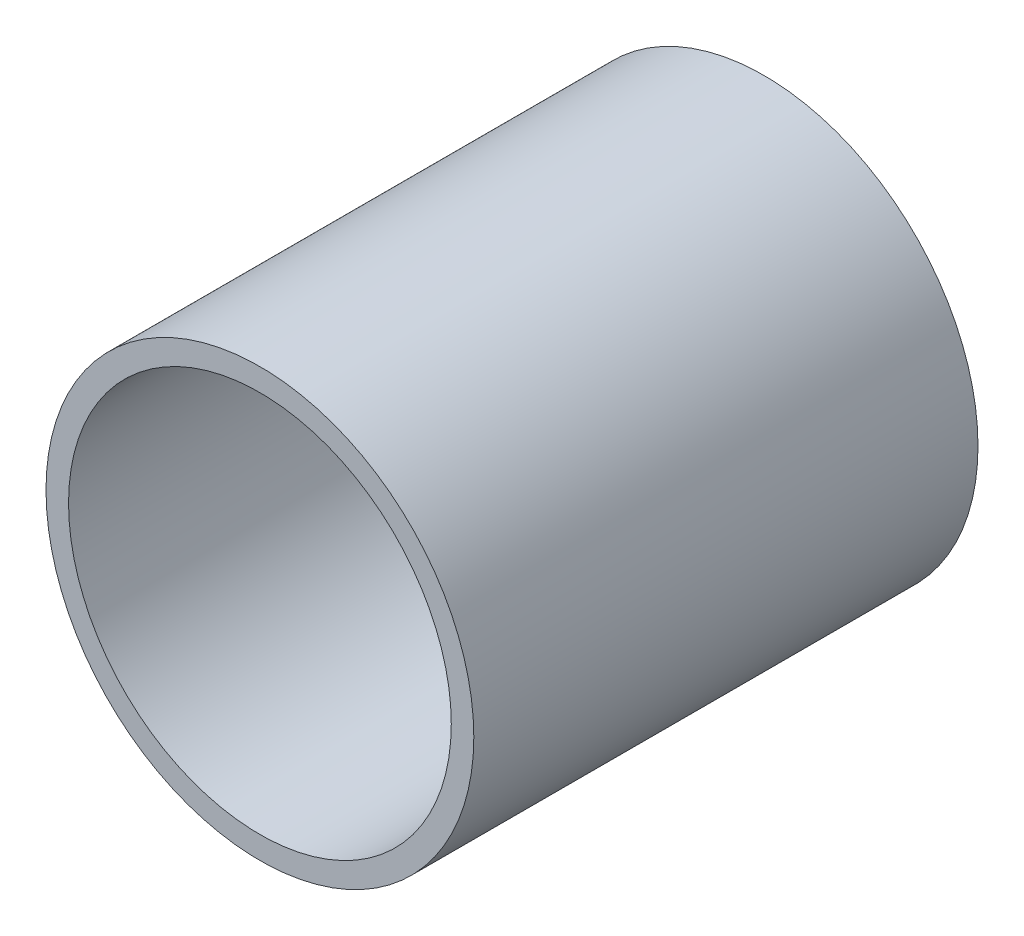
ISO-10303-21;
HEADER;
FILE_DESCRIPTION(('STEP AP214'),'2;1');
FILE_NAME('part.step','',(''),(''),'','','');
FILE_SCHEMA(('AUTOMOTIVE_DESIGN { 1 0 10303 214 1 1 1 1 }'));
ENDSEC;
DATA;
#1=APPLICATION_CONTEXT('core data for automotive mechanical design processes');
#2=APPLICATION_PROTOCOL_DEFINITION('international standard','automotive_design',2000,#1);
#3=PRODUCT_CONTEXT('',#1,'mechanical');
#4=PRODUCT('Part','Part','',(#3));
#5=PRODUCT_RELATED_PRODUCT_CATEGORY('part','',(#4));
#6=PRODUCT_DEFINITION_FORMATION('','',#4);
#7=PRODUCT_DEFINITION_CONTEXT('part definition',#1,'design');
#8=PRODUCT_DEFINITION('design','',#6,#7);
#9=PRODUCT_DEFINITION_SHAPE('','',#8);
#10=(LENGTH_UNIT() NAMED_UNIT(*) SI_UNIT(.MILLI.,.METRE.));
#11=(NAMED_UNIT(*) PLANE_ANGLE_UNIT() SI_UNIT($,.RADIAN.));
#12=(NAMED_UNIT(*) SI_UNIT($,.STERADIAN.) SOLID_ANGLE_UNIT());
#13=UNCERTAINTY_MEASURE_WITH_UNIT(LENGTH_MEASURE(1.E-05),#10,'distance_accuracy_value','');
#14=(GEOMETRIC_REPRESENTATION_CONTEXT(3) GLOBAL_UNCERTAINTY_ASSIGNED_CONTEXT((#13)) GLOBAL_UNIT_ASSIGNED_CONTEXT((#10,
#11,#12)) REPRESENTATION_CONTEXT('',''));
#15=CARTESIAN_POINT('',(0.,0.,0.));
#16=DIRECTION('',(0.,0.,1.));
#17=DIRECTION('',(1.,0.,0.));
#18=AXIS2_PLACEMENT_3D('',#15,#16,#17);
#19=CARTESIAN_POINT('',(0.,0.,67.35));
#20=DIRECTION('',(0.,0.,1.));
#21=DIRECTION('',(1.,0.,0.));
#22=AXIS2_PLACEMENT_3D('',#19,#20,#21);
#23=PLANE('',#22);
#24=CARTESIAN_POINT('',(0.,0.,67.35));
#25=DIRECTION('',(0.,0.,1.));
#26=DIRECTION('',(1.,0.,0.));
#27=AXIS2_PLACEMENT_3D('',#24,#25,#26);
#28=CIRCLE('',#27,57.15);
#29=CARTESIAN_POINT('',(57.15,0.,67.35));
#30=VERTEX_POINT('',#29);
#31=EDGE_CURVE('E11',#30,#30,#28,.T.);
#32=ORIENTED_EDGE('',*,*,#31,.T.);
#33=EDGE_LOOP('',(#32));
#34=FACE_BOUND('',#33,.T.);
#35=CARTESIAN_POINT('',(0.,0.,67.35));
#36=DIRECTION('',(0.,0.,1.));
#37=DIRECTION('',(1.,0.,0.));
#38=AXIS2_PLACEMENT_3D('',#35,#36,#37);
#39=CIRCLE('',#38,51.1302);
#40=CARTESIAN_POINT('',(51.1302,0.,67.35));
#41=VERTEX_POINT('',#40);
#42=EDGE_CURVE('E50',#41,#41,#39,.T.);
#43=ORIENTED_EDGE('',*,*,#42,.F.);
#44=EDGE_LOOP('',(#43));
#45=FACE_BOUND('',#44,.T.);
#46=ADVANCED_FACE('F39',(#34,#45),#23,.T.);
#47=CARTESIAN_POINT('',(0.,0.,-67.35));
#48=DIRECTION('',(0.,0.,1.));
#49=DIRECTION('',(1.,0.,0.));
#50=AXIS2_PLACEMENT_3D('',#47,#48,#49);
#51=PLANE('',#50);
#52=CARTESIAN_POINT('',(0.,0.,-67.35));
#53=DIRECTION('',(0.,0.,1.));
#54=DIRECTION('',(1.,0.,0.));
#55=AXIS2_PLACEMENT_3D('',#52,#53,#54);
#56=CIRCLE('',#55,57.15);
#57=CARTESIAN_POINT('',(57.15,0.,-67.35));
#58=VERTEX_POINT('',#57);
#59=EDGE_CURVE('E43',#58,#58,#56,.T.);
#60=ORIENTED_EDGE('',*,*,#59,.F.);
#61=EDGE_LOOP('',(#60));
#62=FACE_BOUND('',#61,.T.);
#63=CARTESIAN_POINT('',(0.,0.,-67.35));
#64=DIRECTION('',(0.,0.,1.));
#65=DIRECTION('',(1.,0.,0.));
#66=AXIS2_PLACEMENT_3D('',#63,#64,#65);
#67=CIRCLE('',#66,51.1302);
#68=CARTESIAN_POINT('',(51.1302,0.,-67.35));
#69=VERTEX_POINT('',#68);
#70=EDGE_CURVE('E52',#69,#69,#67,.T.);
#71=ORIENTED_EDGE('',*,*,#70,.T.);
#72=EDGE_LOOP('',(#71));
#73=FACE_BOUND('',#72,.T.);
#74=ADVANCED_FACE('F62',(#62,#73),#51,.F.);
#75=CARTESIAN_POINT('',(0.,0.,67.35));
#76=DIRECTION('',(0.,0.,-1.));
#77=DIRECTION('',(-1.,0.,0.));
#78=AXIS2_PLACEMENT_3D('',#75,#76,#77);
#79=CYLINDRICAL_SURFACE('',#78,57.15);
#80=ORIENTED_EDGE('',*,*,#31,.F.);
#81=EDGE_LOOP('',(#80));
#82=FACE_BOUND('',#81,.T.);
#83=ORIENTED_EDGE('',*,*,#59,.T.);
#84=EDGE_LOOP('',(#83));
#85=FACE_BOUND('',#84,.T.);
#86=ADVANCED_FACE('F41',(#82,#85),#79,.T.);
#87=CARTESIAN_POINT('',(0.,0.,67.35));
#88=DIRECTION('',(0.,0.,-1.));
#89=DIRECTION('',(-1.,0.,0.));
#90=AXIS2_PLACEMENT_3D('',#87,#88,#89);
#91=CYLINDRICAL_SURFACE('',#90,51.1302);
#92=ORIENTED_EDGE('',*,*,#42,.T.);
#93=EDGE_LOOP('',(#92));
#94=FACE_BOUND('',#93,.T.);
#95=ORIENTED_EDGE('',*,*,#70,.F.);
#96=EDGE_LOOP('',(#95));
#97=FACE_BOUND('',#96,.T.);
#98=ADVANCED_FACE('F58',(#94,#97),#91,.F.);
#99=CLOSED_SHELL('',(#46,#74,#86,#98));
#100=MANIFOLD_SOLID_BREP('B2',#99);
#101=ADVANCED_BREP_SHAPE_REPRESENTATION('',(#18,#100),#14);
#102=SHAPE_DEFINITION_REPRESENTATION(#9,#101);
ENDSEC;
END-ISO-10303-21;
